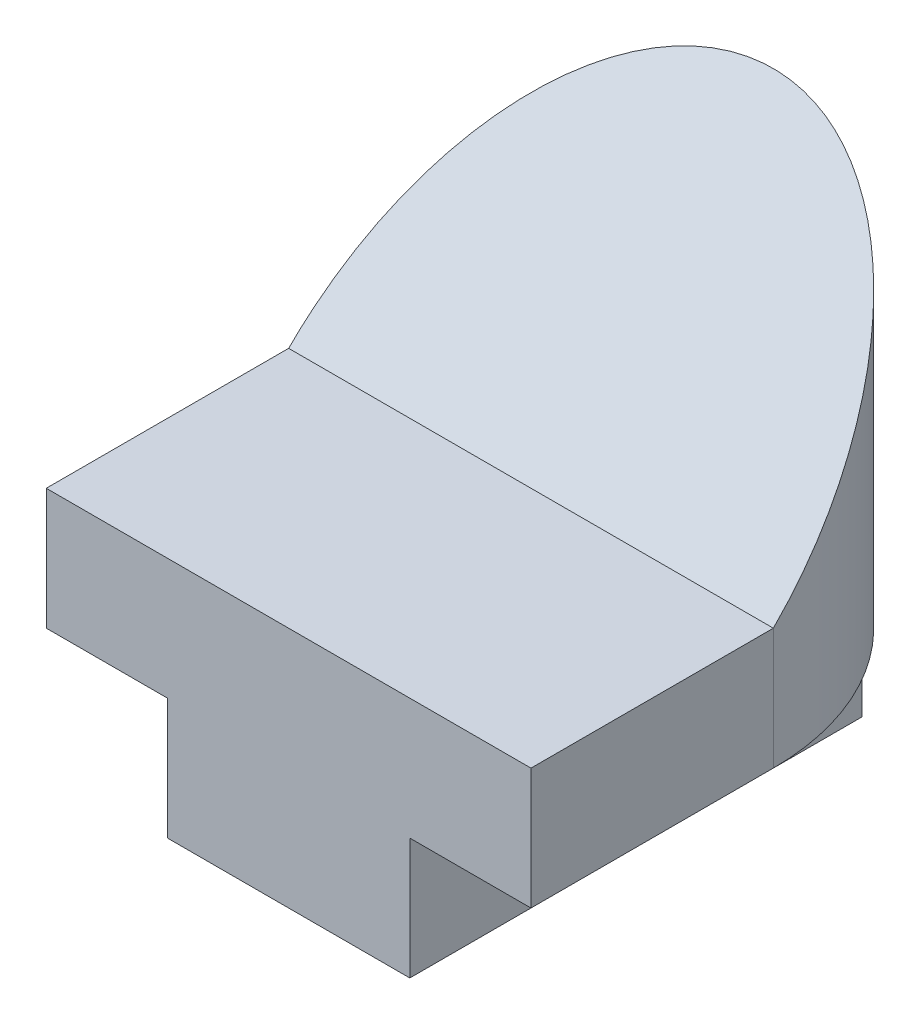
ISO-10303-21;
HEADER;
FILE_DESCRIPTION(('STEP AP214'),'2;1');
FILE_NAME('part.step','',(''),(''),'','','');
FILE_SCHEMA(('AUTOMOTIVE_DESIGN { 1 0 10303 214 1 1 1 1 }'));
ENDSEC;
DATA;
#1=APPLICATION_CONTEXT('core data for automotive mechanical design processes');
#2=APPLICATION_PROTOCOL_DEFINITION('international standard','automotive_design',2000,#1);
#3=PRODUCT_CONTEXT('',#1,'mechanical');
#4=PRODUCT('Part','Part','',(#3));
#5=PRODUCT_RELATED_PRODUCT_CATEGORY('part','',(#4));
#6=PRODUCT_DEFINITION_FORMATION('','',#4);
#7=PRODUCT_DEFINITION_CONTEXT('part definition',#1,'design');
#8=PRODUCT_DEFINITION('design','',#6,#7);
#9=PRODUCT_DEFINITION_SHAPE('','',#8);
#10=(LENGTH_UNIT() NAMED_UNIT(*) SI_UNIT(.MILLI.,.METRE.));
#11=(NAMED_UNIT(*) PLANE_ANGLE_UNIT() SI_UNIT($,.RADIAN.));
#12=(NAMED_UNIT(*) SI_UNIT($,.STERADIAN.) SOLID_ANGLE_UNIT());
#13=UNCERTAINTY_MEASURE_WITH_UNIT(LENGTH_MEASURE(1.E-05),#10,'distance_accuracy_value','');
#14=(GEOMETRIC_REPRESENTATION_CONTEXT(3) GLOBAL_UNCERTAINTY_ASSIGNED_CONTEXT((#13)) GLOBAL_UNIT_ASSIGNED_CONTEXT((#10,
#11,#12)) REPRESENTATION_CONTEXT('',''));
#15=CARTESIAN_POINT('',(0.,0.,0.));
#16=DIRECTION('',(0.,0.,1.));
#17=DIRECTION('',(1.,0.,0.));
#18=AXIS2_PLACEMENT_3D('',#15,#16,#17);
#19=CARTESIAN_POINT('',(0.,0.,40.));
#20=DIRECTION('',(0.,0.,-1.));
#21=DIRECTION('',(-1.,0.,0.));
#22=AXIS2_PLACEMENT_3D('',#19,#20,#21);
#23=PLANE('',#22);
#24=DIRECTION('',(-1.,0.,0.));
#25=VECTOR('',#24,1.);
#26=CARTESIAN_POINT('',(40.,20.,40.));
#27=LINE('',#26,#25);
#28=CARTESIAN_POINT('',(40.,20.,40.));
#29=VERTEX_POINT('',#28);
#30=CARTESIAN_POINT('',(0.,20.,40.));
#31=VERTEX_POINT('',#30);
#32=EDGE_CURVE('E137',#29,#31,#27,.T.);
#33=ORIENTED_EDGE('',*,*,#32,.T.);
#34=DIRECTION('',(0.,-1.,0.));
#35=VECTOR('',#34,1.);
#36=CARTESIAN_POINT('',(0.,0.,40.));
#37=LINE('',#36,#35);
#38=CARTESIAN_POINT('',(0.,10.,40.));
#39=VERTEX_POINT('',#38);
#40=EDGE_CURVE('E163',#31,#39,#37,.T.);
#41=ORIENTED_EDGE('',*,*,#40,.T.);
#42=DIRECTION('',(-1.,0.,0.));
#43=VECTOR('',#42,1.);
#44=CARTESIAN_POINT('',(0.,10.,40.));
#45=LINE('',#44,#43);
#46=CARTESIAN_POINT('',(10.,10.,40.));
#47=VERTEX_POINT('',#46);
#48=EDGE_CURVE('E169',#47,#39,#45,.T.);
#49=ORIENTED_EDGE('',*,*,#48,.F.);
#50=DIRECTION('',(0.,1.,0.));
#51=VECTOR('',#50,1.);
#52=CARTESIAN_POINT('',(10.,0.,40.));
#53=LINE('',#52,#51);
#54=CARTESIAN_POINT('',(10.,0.,40.));
#55=VERTEX_POINT('',#54);
#56=EDGE_CURVE('E173',#55,#47,#53,.T.);
#57=ORIENTED_EDGE('',*,*,#56,.F.);
#58=DIRECTION('',(1.,0.,0.));
#59=VECTOR('',#58,1.);
#60=CARTESIAN_POINT('',(0.,0.,40.));
#61=LINE('',#60,#59);
#62=CARTESIAN_POINT('',(30.,0.,40.));
#63=VERTEX_POINT('',#62);
#64=EDGE_CURVE('E161',#55,#63,#61,.T.);
#65=ORIENTED_EDGE('',*,*,#64,.T.);
#66=DIRECTION('',(0.,-1.,0.));
#67=VECTOR('',#66,1.);
#68=CARTESIAN_POINT('',(30.,0.,40.));
#69=LINE('',#68,#67);
#70=CARTESIAN_POINT('',(30.,10.,40.));
#71=VERTEX_POINT('',#70);
#72=EDGE_CURVE('E179',#71,#63,#69,.T.);
#73=ORIENTED_EDGE('',*,*,#72,.F.);
#74=DIRECTION('',(-1.,0.,0.));
#75=VECTOR('',#74,1.);
#76=CARTESIAN_POINT('',(40.,10.,40.));
#77=LINE('',#76,#75);
#78=CARTESIAN_POINT('',(40.,10.,40.));
#79=VERTEX_POINT('',#78);
#80=EDGE_CURVE('E160',#79,#71,#77,.T.);
#81=ORIENTED_EDGE('',*,*,#80,.F.);
#82=DIRECTION('',(0.,1.,0.));
#83=VECTOR('',#82,1.);
#84=CARTESIAN_POINT('',(40.,0.,40.));
#85=LINE('',#84,#83);
#86=EDGE_CURVE('E77',#79,#29,#85,.T.);
#87=ORIENTED_EDGE('',*,*,#86,.T.);
#88=EDGE_LOOP('',(#33,#41,#49,#57,#65,#73,#81,#87));
#89=FACE_BOUND('',#88,.T.);
#90=ADVANCED_FACE('F69',(#89),#23,.F.);
#91=CARTESIAN_POINT('',(0.,0.,40.));
#92=DIRECTION('',(1.,0.,0.));
#93=DIRECTION('',(0.,0.,-1.));
#94=AXIS2_PLACEMENT_3D('',#91,#92,#93);
#95=PLANE('',#94);
#96=DIRECTION('',(0.,-1.,0.));
#97=VECTOR('',#96,1.);
#98=CARTESIAN_POINT('',(0.,40.,20.));
#99=LINE('',#98,#97);
#100=CARTESIAN_POINT('',(0.,20.,20.));
#101=VERTEX_POINT('',#100);
#102=CARTESIAN_POINT('',(0.,10.,20.));
#103=VERTEX_POINT('',#102);
#104=EDGE_CURVE('E190',#101,#103,#99,.T.);
#105=ORIENTED_EDGE('',*,*,#104,.T.);
#106=DIRECTION('',(0.,0.,1.));
#107=VECTOR('',#106,1.);
#108=CARTESIAN_POINT('',(0.,10.,0.));
#109=LINE('',#108,#107);
#110=EDGE_CURVE('E84',#103,#39,#109,.T.);
#111=ORIENTED_EDGE('',*,*,#110,.T.);
#112=ORIENTED_EDGE('',*,*,#40,.F.);
#113=DIRECTION('',(0.,0.,1.));
#114=VECTOR('',#113,1.);
#115=CARTESIAN_POINT('',(0.,20.,0.));
#116=LINE('',#115,#114);
#117=EDGE_CURVE('E144',#101,#31,#116,.T.);
#118=ORIENTED_EDGE('',*,*,#117,.F.);
#119=EDGE_LOOP('',(#105,#111,#112,#118));
#120=FACE_BOUND('',#119,.T.);
#121=ADVANCED_FACE('F71',(#120),#95,.F.);
#122=CARTESIAN_POINT('',(0.,0.,40.));
#123=DIRECTION('',(0.,1.,0.));
#124=DIRECTION('',(0.,0.,1.));
#125=AXIS2_PLACEMENT_3D('',#122,#123,#124);
#126=PLANE('',#125);
#127=CARTESIAN_POINT('',(20.,0.,20.));
#128=DIRECTION('',(0.,1.,0.));
#129=DIRECTION('',(0.,0.,1.));
#130=AXIS2_PLACEMENT_3D('',#127,#128,#129);
#131=CIRCLE('',#130,20.);
#132=CARTESIAN_POINT('',(30.,0.,2.67949192431123));
#133=VERTEX_POINT('',#132);
#134=CARTESIAN_POINT('',(10.,0.,2.67949192431123));
#135=VERTEX_POINT('',#134);
#136=EDGE_CURVE('E192',#133,#135,#131,.T.);
#137=ORIENTED_EDGE('',*,*,#136,.F.);
#138=DIRECTION('',(0.,0.,1.));
#139=VECTOR('',#138,1.);
#140=CARTESIAN_POINT('',(30.,0.,0.));
#141=LINE('',#140,#139);
#142=EDGE_CURVE('E175',#133,#63,#141,.T.);
#143=ORIENTED_EDGE('',*,*,#142,.T.);
#144=ORIENTED_EDGE('',*,*,#64,.F.);
#145=DIRECTION('',(0.,0.,1.));
#146=VECTOR('',#145,1.);
#147=CARTESIAN_POINT('',(10.,0.,0.));
#148=LINE('',#147,#146);
#149=EDGE_CURVE('E167',#135,#55,#148,.T.);
#150=ORIENTED_EDGE('',*,*,#149,.F.);
#151=EDGE_LOOP('',(#137,#143,#144,#150));
#152=FACE_BOUND('',#151,.T.);
#153=ADVANCED_FACE('F213',(#152),#126,.F.);
#154=CARTESIAN_POINT('',(40.,0.,40.));
#155=DIRECTION('',(-1.,0.,0.));
#156=DIRECTION('',(0.,0.,1.));
#157=AXIS2_PLACEMENT_3D('',#154,#155,#156);
#158=PLANE('',#157);
#159=DIRECTION('',(0.,0.,1.));
#160=VECTOR('',#159,1.);
#161=CARTESIAN_POINT('',(40.,10.,0.));
#162=LINE('',#161,#160);
#163=CARTESIAN_POINT('',(40.,10.,20.));
#164=VERTEX_POINT('',#163);
#165=EDGE_CURVE('E176',#164,#79,#162,.T.);
#166=ORIENTED_EDGE('',*,*,#165,.F.);
#167=DIRECTION('',(0.,-1.,0.));
#168=VECTOR('',#167,1.);
#169=CARTESIAN_POINT('',(40.,40.,20.));
#170=LINE('',#169,#168);
#171=CARTESIAN_POINT('',(40.,20.,20.));
#172=VERTEX_POINT('',#171);
#173=EDGE_CURVE('E147',#172,#164,#170,.T.);
#174=ORIENTED_EDGE('',*,*,#173,.F.);
#175=DIRECTION('',(0.,0.,1.));
#176=VECTOR('',#175,1.);
#177=CARTESIAN_POINT('',(40.,20.,0.));
#178=LINE('',#177,#176);
#179=EDGE_CURVE('E141',#172,#29,#178,.T.);
#180=ORIENTED_EDGE('',*,*,#179,.T.);
#181=ORIENTED_EDGE('',*,*,#86,.F.);
#182=EDGE_LOOP('',(#166,#174,#180,#181));
#183=FACE_BOUND('',#182,.T.);
#184=ADVANCED_FACE('F154',(#183),#158,.F.);
#185=CARTESIAN_POINT('',(0.,10.,0.));
#186=DIRECTION('',(0.,1.,0.));
#187=DIRECTION('',(0.,0.,1.));
#188=AXIS2_PLACEMENT_3D('',#185,#186,#187);
#189=PLANE('',#188);
#190=ORIENTED_EDGE('',*,*,#110,.F.);
#191=CARTESIAN_POINT('',(20.,10.,20.));
#192=DIRECTION('',(0.,1.,0.));
#193=DIRECTION('',(0.,0.,1.));
#194=AXIS2_PLACEMENT_3D('',#191,#192,#193);
#195=CIRCLE('',#194,20.);
#196=CARTESIAN_POINT('',(10.,10.,2.67949192431123));
#197=VERTEX_POINT('',#196);
#198=EDGE_CURVE('E155',#103,#197,#195,.F.);
#199=ORIENTED_EDGE('',*,*,#198,.T.);
#200=DIRECTION('',(0.,0.,1.));
#201=VECTOR('',#200,1.);
#202=CARTESIAN_POINT('',(10.,10.,0.));
#203=LINE('',#202,#201);
#204=EDGE_CURVE('E92',#197,#47,#203,.T.);
#205=ORIENTED_EDGE('',*,*,#204,.T.);
#206=ORIENTED_EDGE('',*,*,#48,.T.);
#207=EDGE_LOOP('',(#190,#199,#205,#206));
#208=FACE_BOUND('',#207,.T.);
#209=ADVANCED_FACE('F207',(#208),#189,.F.);
#210=CARTESIAN_POINT('',(10.,0.,0.));
#211=DIRECTION('',(1.,0.,0.));
#212=DIRECTION('',(0.,0.,-1.));
#213=AXIS2_PLACEMENT_3D('',#210,#211,#212);
#214=PLANE('',#213);
#215=ORIENTED_EDGE('',*,*,#204,.F.);
#216=DIRECTION('',(0.,-1.,0.));
#217=VECTOR('',#216,1.);
#218=CARTESIAN_POINT('',(10.,40.,2.67949192431123));
#219=LINE('',#218,#217);
#220=EDGE_CURVE('E187',#197,#135,#219,.T.);
#221=ORIENTED_EDGE('',*,*,#220,.T.);
#222=ORIENTED_EDGE('',*,*,#149,.T.);
#223=ORIENTED_EDGE('',*,*,#56,.T.);
#224=EDGE_LOOP('',(#215,#221,#222,#223));
#225=FACE_BOUND('',#224,.T.);
#226=ADVANCED_FACE('F209',(#225),#214,.F.);
#227=CARTESIAN_POINT('',(30.,0.,0.));
#228=DIRECTION('',(-1.,0.,0.));
#229=DIRECTION('',(0.,0.,1.));
#230=AXIS2_PLACEMENT_3D('',#227,#228,#229);
#231=PLANE('',#230);
#232=ORIENTED_EDGE('',*,*,#142,.F.);
#233=DIRECTION('',(0.,-1.,0.));
#234=VECTOR('',#233,1.);
#235=CARTESIAN_POINT('',(30.,40.,2.67949192431123));
#236=LINE('',#235,#234);
#237=CARTESIAN_POINT('',(30.,10.,2.67949192431123));
#238=VERTEX_POINT('',#237);
#239=EDGE_CURVE('E194',#133,#238,#236,.F.);
#240=ORIENTED_EDGE('',*,*,#239,.T.);
#241=DIRECTION('',(0.,0.,1.));
#242=VECTOR('',#241,1.);
#243=CARTESIAN_POINT('',(30.,10.,0.));
#244=LINE('',#243,#242);
#245=EDGE_CURVE('E178',#238,#71,#244,.T.);
#246=ORIENTED_EDGE('',*,*,#245,.T.);
#247=ORIENTED_EDGE('',*,*,#72,.T.);
#248=EDGE_LOOP('',(#232,#240,#246,#247));
#249=FACE_BOUND('',#248,.T.);
#250=ADVANCED_FACE('F217',(#249),#231,.F.);
#251=CARTESIAN_POINT('',(40.,10.,0.));
#252=DIRECTION('',(0.,1.,0.));
#253=DIRECTION('',(-1.,0.,0.));
#254=AXIS2_PLACEMENT_3D('',#251,#252,#253);
#255=PLANE('',#254);
#256=ORIENTED_EDGE('',*,*,#245,.F.);
#257=CARTESIAN_POINT('',(20.,10.,20.));
#258=DIRECTION('',(0.,1.,0.));
#259=DIRECTION('',(-1.,0.,0.));
#260=AXIS2_PLACEMENT_3D('',#257,#258,#259);
#261=CIRCLE('',#260,20.);
#262=EDGE_CURVE('E197',#238,#164,#261,.F.);
#263=ORIENTED_EDGE('',*,*,#262,.T.);
#264=ORIENTED_EDGE('',*,*,#165,.T.);
#265=ORIENTED_EDGE('',*,*,#80,.T.);
#266=EDGE_LOOP('',(#256,#263,#264,#265));
#267=FACE_BOUND('',#266,.T.);
#268=ADVANCED_FACE('F220',(#267),#255,.F.);
#269=CARTESIAN_POINT('',(20.,40.,20.));
#270=DIRECTION('',(0.,-1.,0.));
#271=DIRECTION('',(0.,0.,-1.));
#272=AXIS2_PLACEMENT_3D('',#269,#270,#271);
#273=CYLINDRICAL_SURFACE('',#272,20.);
#274=ORIENTED_EDGE('',*,*,#104,.F.);
#275=CARTESIAN_POINT('',(20.,20.,20.));
#276=DIRECTION('',(0.,0.707106781186547,0.707106781186547));
#277=DIRECTION('',(0.,-0.707106781186547,0.707106781186547));
#278=AXIS2_PLACEMENT_3D('',#275,#276,#277);
#279=ELLIPSE('',#278,28.2842712474619,20.);
#280=EDGE_CURVE('E12',#101,#172,#279,.F.);
#281=ORIENTED_EDGE('',*,*,#280,.T.);
#282=ORIENTED_EDGE('',*,*,#173,.T.);
#283=ORIENTED_EDGE('',*,*,#262,.F.);
#284=ORIENTED_EDGE('',*,*,#239,.F.);
#285=ORIENTED_EDGE('',*,*,#136,.T.);
#286=ORIENTED_EDGE('',*,*,#220,.F.);
#287=ORIENTED_EDGE('',*,*,#198,.F.);
#288=EDGE_LOOP('',(#274,#281,#282,#283,#284,#285,#286,#287));
#289=FACE_BOUND('',#288,.T.);
#290=ADVANCED_FACE('F204',(#289),#273,.T.);
#291=CARTESIAN_POINT('',(40.,40.,0.));
#292=DIRECTION('',(0.,0.707106781186548,0.707106781186547));
#293=DIRECTION('',(0.,-0.707106781186547,0.707106781186548));
#294=AXIS2_PLACEMENT_3D('',#291,#292,#293);
#295=PLANE('',#294);
#296=DIRECTION('',(-1.,0.,0.));
#297=VECTOR('',#296,1.);
#298=CARTESIAN_POINT('',(40.,20.,20.));
#299=LINE('',#298,#297);
#300=EDGE_CURVE('E148',#172,#101,#299,.T.);
#301=ORIENTED_EDGE('',*,*,#300,.F.);
#302=ORIENTED_EDGE('',*,*,#280,.F.);
#303=EDGE_LOOP('',(#301,#302));
#304=FACE_BOUND('',#303,.T.);
#305=ADVANCED_FACE('F227',(#304),#295,.T.);
#306=CARTESIAN_POINT('',(40.,20.,20.));
#307=DIRECTION('',(0.,1.,0.));
#308=DIRECTION('',(0.,0.,1.));
#309=AXIS2_PLACEMENT_3D('',#306,#307,#308);
#310=PLANE('',#309);
#311=ORIENTED_EDGE('',*,*,#117,.T.);
#312=ORIENTED_EDGE('',*,*,#32,.F.);
#313=ORIENTED_EDGE('',*,*,#179,.F.);
#314=ORIENTED_EDGE('',*,*,#300,.T.);
#315=EDGE_LOOP('',(#311,#312,#313,#314));
#316=FACE_BOUND('',#315,.T.);
#317=ADVANCED_FACE('F139',(#316),#310,.T.);
#318=CLOSED_SHELL('',(#90,#121,#153,#184,#209,#226,#250,#268,#290,#305,#317));
#319=MANIFOLD_SOLID_BREP('B2',#318);
#320=ADVANCED_BREP_SHAPE_REPRESENTATION('',(#18,#319),#14);
#321=SHAPE_DEFINITION_REPRESENTATION(#9,#320);
ENDSEC;
END-ISO-10303-21;
